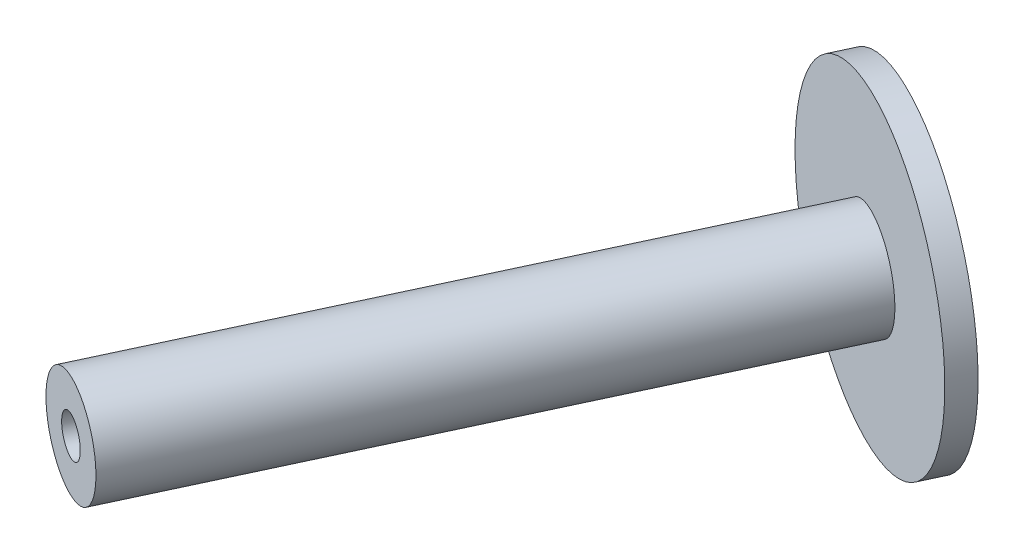
ISO-10303-21;
HEADER;
FILE_DESCRIPTION(('STEP AP214'),'2;1');
FILE_NAME('part.step','',(''),(''),'','','');
FILE_SCHEMA(('AUTOMOTIVE_DESIGN { 1 0 10303 214 1 1 1 1 }'));
ENDSEC;
DATA;
#1=APPLICATION_CONTEXT('core data for automotive mechanical design processes');
#2=APPLICATION_PROTOCOL_DEFINITION('international standard','automotive_design',2000,#1);
#3=PRODUCT_CONTEXT('',#1,'mechanical');
#4=PRODUCT('Part','Part','',(#3));
#5=PRODUCT_RELATED_PRODUCT_CATEGORY('part','',(#4));
#6=PRODUCT_DEFINITION_FORMATION('','',#4);
#7=PRODUCT_DEFINITION_CONTEXT('part definition',#1,'design');
#8=PRODUCT_DEFINITION('design','',#6,#7);
#9=PRODUCT_DEFINITION_SHAPE('','',#8);
#10=(LENGTH_UNIT() NAMED_UNIT(*) SI_UNIT(.MILLI.,.METRE.));
#11=(NAMED_UNIT(*) PLANE_ANGLE_UNIT() SI_UNIT($,.RADIAN.));
#12=(NAMED_UNIT(*) SI_UNIT($,.STERADIAN.) SOLID_ANGLE_UNIT());
#13=UNCERTAINTY_MEASURE_WITH_UNIT(LENGTH_MEASURE(1.E-05),#10,'distance_accuracy_value','');
#14=(GEOMETRIC_REPRESENTATION_CONTEXT(3) GLOBAL_UNCERTAINTY_ASSIGNED_CONTEXT((#13)) GLOBAL_UNIT_ASSIGNED_CONTEXT((#10,
#11,#12)) REPRESENTATION_CONTEXT('',''));
#15=CARTESIAN_POINT('',(0.,0.,0.));
#16=DIRECTION('',(0.,0.,1.));
#17=DIRECTION('',(1.,0.,0.));
#18=AXIS2_PLACEMENT_3D('',#15,#16,#17);
#19=CARTESIAN_POINT('',(-75.1318863937548,74.8033504536845,-6.00264871237026));
#20=DIRECTION('',(-0.422618261740674,0.,0.906307787036662));
#21=DIRECTION('',(0.906307787036662,0.,0.422618261740674));
#22=AXIS2_PLACEMENT_3D('',#19,#20,#21);
#23=PLANE('',#22);
#24=CARTESIAN_POINT('',(-76.2987758585663,74.8033504536845,-6.54677820603222));
#25=DIRECTION('',(0.422618261740674,0.,-0.906307787036662));
#26=DIRECTION('',(-0.906307787036662,0.,-0.422618261740674));
#27=AXIS2_PLACEMENT_3D('',#24,#25,#26);
#28=CIRCLE('',#27,2.57504013868593);
#29=CARTESIAN_POINT('',(-78.6325547881894,74.8033504536845,-7.63503719335614));
#30=VERTEX_POINT('',#29);
#31=EDGE_CURVE('E19',#30,#30,#28,.T.);
#32=ORIENTED_EDGE('',*,*,#31,.F.);
#33=EDGE_LOOP('',(#32));
#34=FACE_BOUND('',#33,.T.);
#35=CARTESIAN_POINT('',(-76.2987758585663,74.8033504536845,-6.54677820603222));
#36=DIRECTION('',(0.422618261740674,0.,-0.906307787036662));
#37=DIRECTION('',(-0.906307787036662,0.,-0.422618261740674));
#38=AXIS2_PLACEMENT_3D('',#35,#36,#37);
#39=CIRCLE('',#38,0.960000000000003);
#40=CARTESIAN_POINT('',(-77.1688313341215,74.8033504536845,-6.95249173730327));
#41=VERTEX_POINT('',#40);
#42=EDGE_CURVE('E35',#41,#41,#39,.T.);
#43=ORIENTED_EDGE('',*,*,#42,.T.);
#44=EDGE_LOOP('',(#43));
#45=FACE_BOUND('',#44,.T.);
#46=ADVANCED_FACE('F15',(#34,#45),#23,.T.);
#47=CARTESIAN_POINT('',(-76.2987758585663,74.8033504536845,-6.54677820603222));
#48=DIRECTION('',(0.422618261740674,0.,-0.906307787036662));
#49=DIRECTION('',(-0.906307787036662,0.,-0.422618261740674));
#50=AXIS2_PLACEMENT_3D('',#47,#48,#49);
#51=CYLINDRICAL_SURFACE('',#50,2.57504013868593);
#52=CARTESIAN_POINT('',(-63.6202280064246,74.8033504536845,-33.7360118169637));
#53=DIRECTION('',(0.422618261740674,0.,-0.906307787036662));
#54=DIRECTION('',(-0.906307787036662,0.,-0.422618261740674));
#55=AXIS2_PLACEMENT_3D('',#52,#53,#54);
#56=CIRCLE('',#55,2.57504013868593);
#57=CARTESIAN_POINT('',(-65.9540069360476,74.8033504536845,-34.8242708042876));
#58=VERTEX_POINT('',#57);
#59=EDGE_CURVE('E33',#58,#58,#56,.T.);
#60=ORIENTED_EDGE('',*,*,#59,.F.);
#61=EDGE_LOOP('',(#60));
#62=FACE_BOUND('',#61,.T.);
#63=ORIENTED_EDGE('',*,*,#31,.T.);
#64=EDGE_LOOP('',(#63));
#65=FACE_BOUND('',#64,.T.);
#66=ADVANCED_FACE('F42',(#62,#65),#51,.T.);
#67=CARTESIAN_POINT('',(-76.2987758585663,74.8033504536845,-6.54677820603222));
#68=DIRECTION('',(0.422618261740674,0.,-0.906307787036662));
#69=DIRECTION('',(-0.906307787036662,0.,-0.422618261740674));
#70=AXIS2_PLACEMENT_3D('',#67,#68,#69);
#71=CYLINDRICAL_SURFACE('',#70,0.960000000000003);
#72=ORIENTED_EDGE('',*,*,#42,.F.);
#73=EDGE_LOOP('',(#72));
#74=FACE_BOUND('',#73,.T.);
#75=CARTESIAN_POINT('',(-63.0919551791117,74.8033504536845,-34.8688965510535));
#76=DIRECTION('',(0.422618261740674,0.,-0.906307787036662));
#77=DIRECTION('',(-0.906307787036662,0.,-0.422618261740674));
#78=AXIS2_PLACEMENT_3D('',#75,#76,#77);
#79=CIRCLE('',#78,0.960000000000003);
#80=CARTESIAN_POINT('',(-63.9620106546669,74.8033504536845,-35.2746100823245));
#81=VERTEX_POINT('',#80);
#82=EDGE_CURVE('E28',#81,#81,#79,.F.);
#83=ORIENTED_EDGE('',*,*,#82,.F.);
#84=EDGE_LOOP('',(#83));
#85=FACE_BOUND('',#84,.T.);
#86=ADVANCED_FACE('F50',(#74,#85),#71,.F.);
#87=CARTESIAN_POINT('',(-58.9526701471785,74.8033504536845,-31.5594938423159));
#88=DIRECTION('',(-0.422618261740674,0.,0.906307787036662));
#89=DIRECTION('',(0.906307787036662,0.,0.422618261740674));
#90=AXIS2_PLACEMENT_3D('',#87,#88,#89);
#91=PLANE('',#90);
#92=ORIENTED_EDGE('',*,*,#59,.T.);
#93=EDGE_LOOP('',(#92));
#94=FACE_BOUND('',#93,.T.);
#95=CARTESIAN_POINT('',(-63.6202280064246,74.8033504536845,-33.7360118169637));
#96=DIRECTION('',(0.422618261740673,0.,-0.906307787036662));
#97=DIRECTION('',(-0.906307787036662,0.,-0.422618261740673));
#98=AXIS2_PLACEMENT_3D('',#95,#96,#97);
#99=CIRCLE('',#98,7.72512041605779);
#100=CARTESIAN_POINT('',(-70.6215647952937,74.8033504536845,-37.0007887789354));
#101=VERTEX_POINT('',#100);
#102=EDGE_CURVE('E23',#101,#101,#99,.T.);
#103=ORIENTED_EDGE('',*,*,#102,.F.);
#104=EDGE_LOOP('',(#103));
#105=FACE_BOUND('',#104,.T.);
#106=ADVANCED_FACE('F59',(#94,#105),#91,.T.);
#107=CARTESIAN_POINT('',(-59.5912867846772,74.8033504536845,-33.2365080700676));
#108=DIRECTION('',(0.422618261740674,0.,-0.906307787036662));
#109=DIRECTION('',(-0.906307787036662,0.,-0.422618261740674));
#110=AXIS2_PLACEMENT_3D('',#107,#108,#109);
#111=PLANE('',#110);
#112=CARTESIAN_POINT('',(-63.0919551791117,74.8033504536845,-34.8688965510535));
#113=DIRECTION('',(0.422618261740673,0.,-0.906307787036662));
#114=DIRECTION('',(-0.906307787036662,0.,-0.422618261740673));
#115=AXIS2_PLACEMENT_3D('',#112,#113,#114);
#116=CIRCLE('',#115,7.72512041605779);
#117=CARTESIAN_POINT('',(-70.0932919679807,74.8033504536845,-38.1336735130252));
#118=VERTEX_POINT('',#117);
#119=EDGE_CURVE('E10',#118,#118,#116,.F.);
#120=ORIENTED_EDGE('',*,*,#119,.F.);
#121=EDGE_LOOP('',(#120));
#122=FACE_BOUND('',#121,.T.);
#123=ORIENTED_EDGE('',*,*,#82,.T.);
#124=EDGE_LOOP('',(#123));
#125=FACE_BOUND('',#124,.T.);
#126=ADVANCED_FACE('F54',(#122,#125),#111,.T.);
#127=CARTESIAN_POINT('',(-63.6202280064246,74.8033504536845,-33.7360118169637));
#128=DIRECTION('',(0.422618261740673,0.,-0.906307787036662));
#129=DIRECTION('',(-0.906307787036662,0.,-0.422618261740673));
#130=AXIS2_PLACEMENT_3D('',#127,#128,#129);
#131=CYLINDRICAL_SURFACE('',#130,7.72512041605779);
#132=ORIENTED_EDGE('',*,*,#102,.T.);
#133=EDGE_LOOP('',(#132));
#134=FACE_BOUND('',#133,.T.);
#135=ORIENTED_EDGE('',*,*,#119,.T.);
#136=EDGE_LOOP('',(#135));
#137=FACE_BOUND('',#136,.T.);
#138=ADVANCED_FACE('F17',(#134,#137),#131,.T.);
#139=CLOSED_SHELL('',(#46,#66,#86,#106,#126,#138));
#140=MANIFOLD_SOLID_BREP('B1',#139);
#141=ADVANCED_BREP_SHAPE_REPRESENTATION('',(#18,#140),#14);
#142=SHAPE_DEFINITION_REPRESENTATION(#9,#141);
ENDSEC;
END-ISO-10303-21;
